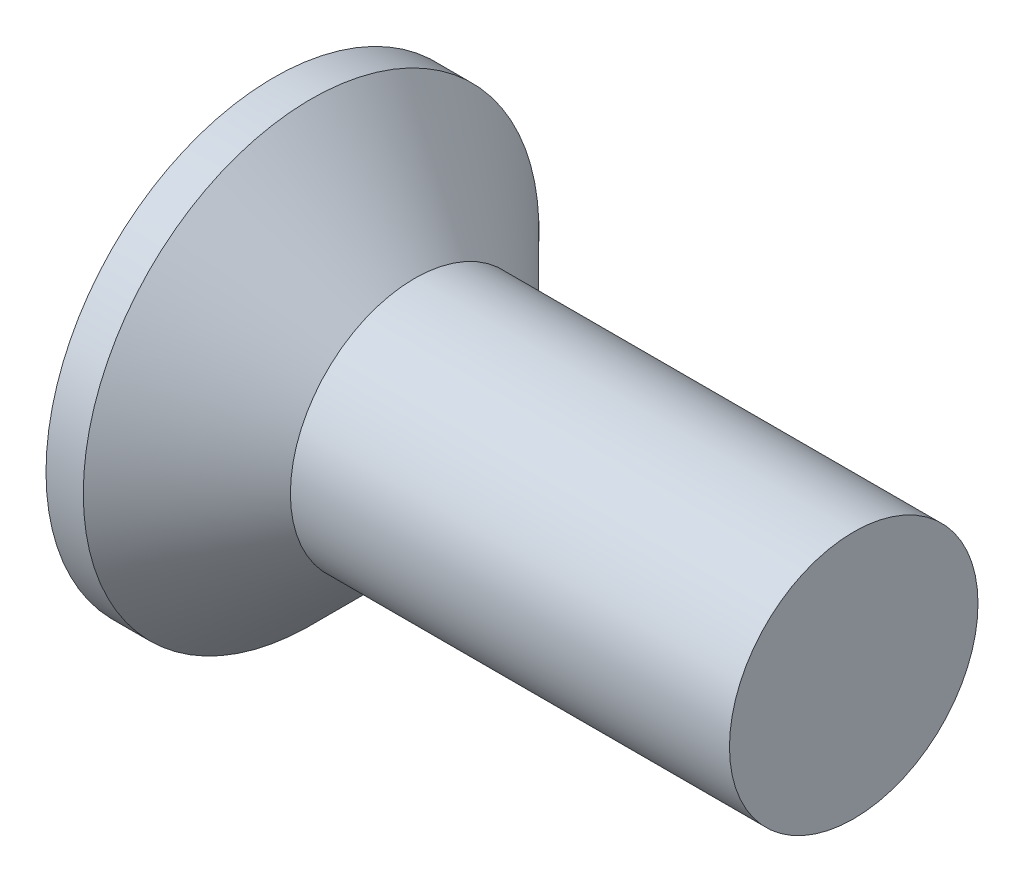
ISO-10303-21;
HEADER;
FILE_DESCRIPTION(('STEP AP214'),'2;1');
FILE_NAME('part.step','',(''),(''),'','','');
FILE_SCHEMA(('AUTOMOTIVE_DESIGN { 1 0 10303 214 1 1 1 1 }'));
ENDSEC;
DATA;
#1=APPLICATION_CONTEXT('core data for automotive mechanical design processes');
#2=APPLICATION_PROTOCOL_DEFINITION('international standard','automotive_design',2000,#1);
#3=PRODUCT_CONTEXT('',#1,'mechanical');
#4=PRODUCT('Part','Part','',(#3));
#5=PRODUCT_RELATED_PRODUCT_CATEGORY('part','',(#4));
#6=PRODUCT_DEFINITION_FORMATION('','',#4);
#7=PRODUCT_DEFINITION_CONTEXT('part definition',#1,'design');
#8=PRODUCT_DEFINITION('design','',#6,#7);
#9=PRODUCT_DEFINITION_SHAPE('','',#8);
#10=(LENGTH_UNIT() NAMED_UNIT(*) SI_UNIT(.MILLI.,.METRE.));
#11=(NAMED_UNIT(*) PLANE_ANGLE_UNIT() SI_UNIT($,.RADIAN.));
#12=(NAMED_UNIT(*) SI_UNIT($,.STERADIAN.) SOLID_ANGLE_UNIT());
#13=UNCERTAINTY_MEASURE_WITH_UNIT(LENGTH_MEASURE(1.E-05),#10,'distance_accuracy_value','');
#14=(GEOMETRIC_REPRESENTATION_CONTEXT(3) GLOBAL_UNCERTAINTY_ASSIGNED_CONTEXT((#13)) GLOBAL_UNIT_ASSIGNED_CONTEXT((#10,
#11,#12)) REPRESENTATION_CONTEXT('',''));
#15=CARTESIAN_POINT('',(0.,0.,0.));
#16=DIRECTION('',(0.,0.,1.));
#17=DIRECTION('',(1.,0.,0.));
#18=AXIS2_PLACEMENT_3D('',#15,#16,#17);
#19=CARTESIAN_POINT('',(0.,0.,0.));
#20=DIRECTION('',(-1.,0.,0.));
#21=DIRECTION('',(0.,0.,1.));
#22=AXIS2_PLACEMENT_3D('',#19,#20,#21);
#23=PLANE('',#22);
#24=CARTESIAN_POINT('',(0.,0.,0.));
#25=DIRECTION('',(-1.,0.,0.));
#26=DIRECTION('',(0.,0.,1.));
#27=AXIS2_PLACEMENT_3D('',#24,#25,#26);
#28=CIRCLE('',#27,2.75);
#29=CARTESIAN_POINT('',(0.,0.,2.75));
#30=VERTEX_POINT('',#29);
#31=EDGE_CURVE('E41',#30,#30,#28,.T.);
#32=ORIENTED_EDGE('',*,*,#31,.T.);
#33=EDGE_LOOP('',(#32));
#34=FACE_BOUND('',#33,.T.);
#35=DIRECTION('',(0.,1.,0.));
#36=VECTOR('',#35,1.);
#37=CARTESIAN_POINT('',(0.,-1.55,-0.395));
#38=LINE('',#37,#36);
#39=CARTESIAN_POINT('',(0.,-1.55,-0.395));
#40=VERTEX_POINT('',#39);
#41=CARTESIAN_POINT('',(0.,-0.394999999999999,-0.395));
#42=VERTEX_POINT('',#41);
#43=EDGE_CURVE('E102',#40,#42,#38,.T.);
#44=ORIENTED_EDGE('',*,*,#43,.T.);
#45=DIRECTION('',(0.,0.,-1.));
#46=VECTOR('',#45,1.);
#47=CARTESIAN_POINT('',(0.,-0.395000000000005,1.55));
#48=LINE('',#47,#46);
#49=CARTESIAN_POINT('',(0.,-0.394999999999994,-1.55));
#50=VERTEX_POINT('',#49);
#51=EDGE_CURVE('E82',#42,#50,#48,.T.);
#52=ORIENTED_EDGE('',*,*,#51,.T.);
#53=DIRECTION('',(0.,1.,0.));
#54=VECTOR('',#53,1.);
#55=CARTESIAN_POINT('',(0.,-0.394999999999994,-1.55));
#56=LINE('',#55,#54);
#57=CARTESIAN_POINT('',(0.,0.395000000000005,-1.55));
#58=VERTEX_POINT('',#57);
#59=EDGE_CURVE('E343',#50,#58,#56,.T.);
#60=ORIENTED_EDGE('',*,*,#59,.T.);
#61=DIRECTION('',(0.,0.,1.));
#62=VECTOR('',#61,1.);
#63=CARTESIAN_POINT('',(0.,0.395000000000005,-1.55));
#64=LINE('',#63,#62);
#65=CARTESIAN_POINT('',(0.,0.395000000000001,-0.395));
#66=VERTEX_POINT('',#65);
#67=EDGE_CURVE('E98',#58,#66,#64,.T.);
#68=ORIENTED_EDGE('',*,*,#67,.T.);
#69=CARTESIAN_POINT('',(0.,1.55,-0.395));
#70=VERTEX_POINT('',#69);
#71=EDGE_CURVE('E92',#66,#70,#38,.T.);
#72=ORIENTED_EDGE('',*,*,#71,.T.);
#73=DIRECTION('',(0.,0.,1.));
#74=VECTOR('',#73,1.);
#75=CARTESIAN_POINT('',(0.,1.55,-0.395));
#76=LINE('',#75,#74);
#77=CARTESIAN_POINT('',(0.,1.55,0.395));
#78=VERTEX_POINT('',#77);
#79=EDGE_CURVE('E95',#70,#78,#76,.T.);
#80=ORIENTED_EDGE('',*,*,#79,.T.);
#81=DIRECTION('',(0.,-1.,0.));
#82=VECTOR('',#81,1.);
#83=CARTESIAN_POINT('',(0.,1.55,0.395));
#84=LINE('',#83,#82);
#85=CARTESIAN_POINT('',(0.,0.394999999999998,0.395));
#86=VERTEX_POINT('',#85);
#87=EDGE_CURVE('E355',#78,#86,#84,.T.);
#88=ORIENTED_EDGE('',*,*,#87,.T.);
#89=CARTESIAN_POINT('',(0.,0.394999999999994,1.55));
#90=VERTEX_POINT('',#89);
#91=EDGE_CURVE('E338',#86,#90,#64,.T.);
#92=ORIENTED_EDGE('',*,*,#91,.T.);
#93=DIRECTION('',(0.,-1.,0.));
#94=VECTOR('',#93,1.);
#95=CARTESIAN_POINT('',(0.,0.394999999999994,1.55));
#96=LINE('',#95,#94);
#97=CARTESIAN_POINT('',(0.,-0.395000000000005,1.55));
#98=VERTEX_POINT('',#97);
#99=EDGE_CURVE('E324',#90,#98,#96,.T.);
#100=ORIENTED_EDGE('',*,*,#99,.T.);
#101=CARTESIAN_POINT('',(0.,-0.395000000000001,0.395));
#102=VERTEX_POINT('',#101);
#103=EDGE_CURVE('E336',#98,#102,#48,.T.);
#104=ORIENTED_EDGE('',*,*,#103,.T.);
#105=CARTESIAN_POINT('',(0.,-1.55,0.395));
#106=VERTEX_POINT('',#105);
#107=EDGE_CURVE('E108',#102,#106,#84,.T.);
#108=ORIENTED_EDGE('',*,*,#107,.T.);
#109=DIRECTION('',(0.,0.,-1.));
#110=VECTOR('',#109,1.);
#111=CARTESIAN_POINT('',(0.,-1.55,0.395));
#112=LINE('',#111,#110);
#113=EDGE_CURVE('E131',#106,#40,#112,.T.);
#114=ORIENTED_EDGE('',*,*,#113,.T.);
#115=EDGE_LOOP('',(#44,#52,#60,#68,#72,#80,#88,#92,#100,#104,#108,#114));
#116=FACE_BOUND('',#115,.T.);
#117=ADVANCED_FACE('F34',(#34,#116),#23,.T.);
#118=CARTESIAN_POINT('',(2.38373382624769,0.,0.168659889094269));
#119=DIRECTION('',(-0.0945267588569114,0.,-0.995522321125954));
#120=DIRECTION('',(-0.995522321125954,0.,0.0945267588569114));
#121=AXIS2_PLACEMENT_3D('',#118,#119,#120);
#122=PLANE('',#121);
#123=ORIENTED_EDGE('',*,*,#107,.F.);
#124=DIRECTION('',(0.991104257398676,0.0941072552097303,-0.09410725520973));
#125=VECTOR('',#124,1.);
#126=CARTESIAN_POINT('',(2.39946475118715,-0.167166207519493,0.167166207519491));
#127=LINE('',#126,#125);
#128=CARTESIAN_POINT('',(2.08,-0.197500000000003,0.1975));
#129=VERTEX_POINT('',#128);
#130=EDGE_CURVE('E126',#102,#129,#127,.T.);
#131=ORIENTED_EDGE('',*,*,#130,.T.);
#132=DIRECTION('',(0.835707904588478,0.543411029305728,-0.0793520726712617));
#133=VECTOR('',#132,1.);
#134=CARTESIAN_POINT('',(0.,-1.55,0.395));
#135=LINE('',#134,#133);
#136=EDGE_CURVE('E103',#106,#129,#135,.T.);
#137=ORIENTED_EDGE('',*,*,#136,.F.);
#138=EDGE_LOOP('',(#123,#131,#137));
#139=FACE_BOUND('',#138,.T.);
#140=ADVANCED_FACE('F155',(#139),#122,.T.);
#141=DIRECTION('',(0.835707904588477,-0.543411029305729,-0.0793520726712615));
#142=VECTOR('',#141,1.);
#143=CARTESIAN_POINT('',(0.,1.55,0.395));
#144=LINE('',#143,#142);
#145=CARTESIAN_POINT('',(2.08,0.197499999999997,0.1975));
#146=VERTEX_POINT('',#145);
#147=EDGE_CURVE('E48',#78,#146,#144,.T.);
#148=ORIENTED_EDGE('',*,*,#147,.T.);
#149=DIRECTION('',(-0.991104257398676,0.0941072552097295,0.0941072552097299));
#150=VECTOR('',#149,1.);
#151=CARTESIAN_POINT('',(2.39946475118715,0.167166207519486,0.167166207519491));
#152=LINE('',#151,#150);
#153=EDGE_CURVE('E351',#146,#86,#152,.T.);
#154=ORIENTED_EDGE('',*,*,#153,.T.);
#155=ORIENTED_EDGE('',*,*,#87,.F.);
#156=EDGE_LOOP('',(#148,#154,#155));
#157=FACE_BOUND('',#156,.T.);
#158=ADVANCED_FACE('F159',(#157),#122,.T.);
#159=CARTESIAN_POINT('',(2.38373382624769,0.,-0.168659889094269));
#160=DIRECTION('',(-0.0945267588569113,0.,0.995522321125954));
#161=DIRECTION('',(0.995522321125954,0.,0.0945267588569113));
#162=AXIS2_PLACEMENT_3D('',#159,#160,#161);
#163=PLANE('',#162);
#164=DIRECTION('',(0.835707904588478,0.543411029305728,0.0793520726712615));
#165=VECTOR('',#164,1.);
#166=CARTESIAN_POINT('',(0.,-1.55,-0.395));
#167=LINE('',#166,#165);
#168=CARTESIAN_POINT('',(2.08,-0.197500000000002,-0.1975));
#169=VERTEX_POINT('',#168);
#170=EDGE_CURVE('E57',#40,#169,#167,.T.);
#171=ORIENTED_EDGE('',*,*,#170,.T.);
#172=DIRECTION('',(-0.991104257398676,-0.0941072552097296,-0.0941072552097298));
#173=VECTOR('',#172,1.);
#174=CARTESIAN_POINT('',(2.39946475118715,-0.167166207519491,-0.167166207519488));
#175=LINE('',#174,#173);
#176=EDGE_CURVE('E11',#169,#42,#175,.T.);
#177=ORIENTED_EDGE('',*,*,#176,.T.);
#178=ORIENTED_EDGE('',*,*,#43,.F.);
#179=EDGE_LOOP('',(#171,#177,#178));
#180=FACE_BOUND('',#179,.T.);
#181=ADVANCED_FACE('F152',(#180),#163,.T.);
#182=ORIENTED_EDGE('',*,*,#71,.F.);
#183=DIRECTION('',(0.991104257398676,-0.0941072552097302,0.0941072552097298));
#184=VECTOR('',#183,1.);
#185=CARTESIAN_POINT('',(2.39946475118715,0.167166207519488,-0.167166207519488));
#186=LINE('',#185,#184);
#187=CARTESIAN_POINT('',(2.08,0.197499999999997,-0.1975));
#188=VERTEX_POINT('',#187);
#189=EDGE_CURVE('E111',#66,#188,#186,.T.);
#190=ORIENTED_EDGE('',*,*,#189,.T.);
#191=DIRECTION('',(0.835707904588477,-0.543411029305729,0.0793520726712615));
#192=VECTOR('',#191,1.);
#193=CARTESIAN_POINT('',(0.,1.55,-0.395));
#194=LINE('',#193,#192);
#195=EDGE_CURVE('E107',#70,#188,#194,.T.);
#196=ORIENTED_EDGE('',*,*,#195,.F.);
#197=EDGE_LOOP('',(#182,#190,#196));
#198=FACE_BOUND('',#197,.T.);
#199=ADVANCED_FACE('F110',(#198),#163,.T.);
#200=CARTESIAN_POINT('',(-6.34999999999999,0.,0.));
#201=DIRECTION('',(-1.,0.,0.));
#202=DIRECTION('',(0.,0.,1.));
#203=AXIS2_PLACEMENT_3D('',#200,#201,#202);
#204=CYLINDRICAL_SURFACE('',#203,2.75);
#205=CARTESIAN_POINT('',(0.450000000000005,0.,0.));
#206=DIRECTION('',(-1.,0.,0.));
#207=DIRECTION('',(0.,0.,1.));
#208=AXIS2_PLACEMENT_3D('',#205,#206,#207);
#209=CIRCLE('',#208,2.75);
#210=CARTESIAN_POINT('',(0.450000000000005,0.,2.75));
#211=VERTEX_POINT('',#210);
#212=EDGE_CURVE('E134',#211,#211,#209,.T.);
#213=ORIENTED_EDGE('',*,*,#212,.T.);
#214=EDGE_LOOP('',(#213));
#215=FACE_BOUND('',#214,.T.);
#216=ORIENTED_EDGE('',*,*,#31,.F.);
#217=EDGE_LOOP('',(#216));
#218=FACE_BOUND('',#217,.T.);
#219=ADVANCED_FACE('F141',(#215,#218),#204,.T.);
#220=CARTESIAN_POINT('',(0.450000000000005,0.,0.));
#221=DIRECTION('',(-1.,0.,0.));
#222=DIRECTION('',(0.,0.,1.));
#223=AXIS2_PLACEMENT_3D('',#220,#221,#222);
#224=CONICAL_SURFACE('',#223,2.75,0.78539816339745);
#225=CARTESIAN_POINT('',(1.7,0.,0.));
#226=DIRECTION('',(-1.,0.,0.));
#227=DIRECTION('',(0.,0.,1.));
#228=AXIS2_PLACEMENT_3D('',#225,#226,#227);
#229=CIRCLE('',#228,1.5);
#230=CARTESIAN_POINT('',(1.7,0.,1.5));
#231=VERTEX_POINT('',#230);
#232=EDGE_CURVE('E130',#231,#231,#229,.T.);
#233=ORIENTED_EDGE('',*,*,#232,.T.);
#234=EDGE_LOOP('',(#233));
#235=FACE_BOUND('',#234,.T.);
#236=ORIENTED_EDGE('',*,*,#212,.F.);
#237=EDGE_LOOP('',(#236));
#238=FACE_BOUND('',#237,.T.);
#239=ADVANCED_FACE('F143',(#235,#238),#224,.T.);
#240=CARTESIAN_POINT('',(-6.34999999999999,0.,0.));
#241=DIRECTION('',(-1.,0.,0.));
#242=DIRECTION('',(0.,0.,1.));
#243=AXIS2_PLACEMENT_3D('',#240,#241,#242);
#244=CYLINDRICAL_SURFACE('',#243,1.5);
#245=CARTESIAN_POINT('',(7.,0.,0.));
#246=DIRECTION('',(-1.,0.,0.));
#247=DIRECTION('',(0.,0.,1.));
#248=AXIS2_PLACEMENT_3D('',#245,#246,#247);
#249=CIRCLE('',#248,1.5);
#250=CARTESIAN_POINT('',(7.,0.,1.5));
#251=VERTEX_POINT('',#250);
#252=EDGE_CURVE('E127',#251,#251,#249,.T.);
#253=ORIENTED_EDGE('',*,*,#252,.T.);
#254=EDGE_LOOP('',(#253));
#255=FACE_BOUND('',#254,.T.);
#256=ORIENTED_EDGE('',*,*,#232,.F.);
#257=EDGE_LOOP('',(#256));
#258=FACE_BOUND('',#257,.T.);
#259=ADVANCED_FACE('F149',(#255,#258),#244,.T.);
#260=CARTESIAN_POINT('',(7.,1.5,0.));
#261=DIRECTION('',(1.,0.,0.));
#262=DIRECTION('',(0.,0.,-1.));
#263=AXIS2_PLACEMENT_3D('',#260,#261,#262);
#264=PLANE('',#263);
#265=ORIENTED_EDGE('',*,*,#252,.F.);
#266=EDGE_LOOP('',(#265));
#267=FACE_BOUND('',#266,.T.);
#268=ADVANCED_FACE('F179',(#267),#264,.T.);
#269=CARTESIAN_POINT('',(2.08,0.197499999999997,-0.1975));
#270=DIRECTION('',(1.,0.,0.));
#271=DIRECTION('',(0.,0.,-1.));
#272=AXIS2_PLACEMENT_3D('',#269,#270,#271);
#273=PLANE('',#272);
#274=DIRECTION('',(0.,1.,0.));
#275=VECTOR('',#274,1.);
#276=CARTESIAN_POINT('',(2.08,-0.197500000000002,-0.1975));
#277=LINE('',#276,#275);
#278=EDGE_CURVE('E122',#169,#188,#277,.T.);
#279=ORIENTED_EDGE('',*,*,#278,.F.);
#280=DIRECTION('',(0.,0.,-1.));
#281=VECTOR('',#280,1.);
#282=CARTESIAN_POINT('',(2.08,-0.197500000000002,0.1975));
#283=LINE('',#282,#281);
#284=EDGE_CURVE('E113',#129,#169,#283,.T.);
#285=ORIENTED_EDGE('',*,*,#284,.F.);
#286=DIRECTION('',(0.,-1.,0.));
#287=VECTOR('',#286,1.);
#288=CARTESIAN_POINT('',(2.08,0.197499999999997,0.1975));
#289=LINE('',#288,#287);
#290=EDGE_CURVE('E116',#146,#129,#289,.T.);
#291=ORIENTED_EDGE('',*,*,#290,.F.);
#292=DIRECTION('',(0.,0.,1.));
#293=VECTOR('',#292,1.);
#294=CARTESIAN_POINT('',(2.08,0.197499999999997,-0.1975));
#295=LINE('',#294,#293);
#296=EDGE_CURVE('E120',#188,#146,#295,.T.);
#297=ORIENTED_EDGE('',*,*,#296,.F.);
#298=EDGE_LOOP('',(#279,#285,#291,#297));
#299=FACE_BOUND('',#298,.T.);
#300=ADVANCED_FACE('F176',(#299),#273,.F.);
#301=CARTESIAN_POINT('',(0.,-1.55,-0.395));
#302=DIRECTION('',(-0.54513001368185,0.838351518268576,0.));
#303=DIRECTION('',(-0.838351518268576,-0.54513001368185,0.));
#304=AXIS2_PLACEMENT_3D('',#301,#302,#303);
#305=PLANE('',#304);
#306=ORIENTED_EDGE('',*,*,#170,.F.);
#307=ORIENTED_EDGE('',*,*,#113,.F.);
#308=ORIENTED_EDGE('',*,*,#136,.T.);
#309=ORIENTED_EDGE('',*,*,#284,.T.);
#310=EDGE_LOOP('',(#306,#307,#308,#309));
#311=FACE_BOUND('',#310,.T.);
#312=ADVANCED_FACE('F168',(#311),#305,.T.);
#313=CARTESIAN_POINT('',(2.08,0.197499999999997,0.1975));
#314=DIRECTION('',(-0.54513001368185,-0.838351518268575,0.));
#315=DIRECTION('',(0.838351518268576,-0.54513001368185,0.));
#316=AXIS2_PLACEMENT_3D('',#313,#314,#315);
#317=PLANE('',#316);
#318=ORIENTED_EDGE('',*,*,#147,.F.);
#319=ORIENTED_EDGE('',*,*,#79,.F.);
#320=ORIENTED_EDGE('',*,*,#195,.T.);
#321=ORIENTED_EDGE('',*,*,#296,.T.);
#322=EDGE_LOOP('',(#318,#319,#320,#321));
#323=FACE_BOUND('',#322,.T.);
#324=ADVANCED_FACE('F106',(#323),#317,.T.);
#325=CARTESIAN_POINT('',(2.38373382624769,-0.168659889094273,0.));
#326=DIRECTION('',(-0.0945267588569114,0.995522321125954,0.));
#327=DIRECTION('',(-0.995522321125954,-0.0945267588569114,0.));
#328=AXIS2_PLACEMENT_3D('',#325,#326,#327);
#329=PLANE('',#328);
#330=DIRECTION('',(0.835707904588478,0.0793520726712598,0.543411029305728));
#331=VECTOR('',#330,1.);
#332=CARTESIAN_POINT('',(0.,-0.394999999999994,-1.55));
#333=LINE('',#332,#331);
#334=EDGE_CURVE('E345',#50,#169,#333,.T.);
#335=ORIENTED_EDGE('',*,*,#334,.F.);
#336=ORIENTED_EDGE('',*,*,#51,.F.);
#337=ORIENTED_EDGE('',*,*,#176,.F.);
#338=EDGE_LOOP('',(#335,#336,#337));
#339=FACE_BOUND('',#338,.T.);
#340=ADVANCED_FACE('F175',(#339),#329,.T.);
#341=CARTESIAN_POINT('',(2.38373382624769,0.168659889094268,0.));
#342=DIRECTION('',(-0.0945267588569113,-0.995522321125954,0.));
#343=DIRECTION('',(0.995522321125954,-0.0945267588569113,0.));
#344=AXIS2_PLACEMENT_3D('',#341,#342,#343);
#345=PLANE('',#344);
#346=ORIENTED_EDGE('',*,*,#67,.F.);
#347=DIRECTION('',(0.835707904588478,-0.0793520726712634,0.543411029305728));
#348=VECTOR('',#347,1.);
#349=CARTESIAN_POINT('',(0.,0.395000000000005,-1.55));
#350=LINE('',#349,#348);
#351=EDGE_CURVE('E73',#58,#188,#350,.T.);
#352=ORIENTED_EDGE('',*,*,#351,.T.);
#353=ORIENTED_EDGE('',*,*,#189,.F.);
#354=EDGE_LOOP('',(#346,#352,#353));
#355=FACE_BOUND('',#354,.T.);
#356=ADVANCED_FACE('F219',(#355),#345,.T.);
#357=CARTESIAN_POINT('',(0.,0.395000000000005,-1.55));
#358=DIRECTION('',(-0.54513001368185,0.,0.838351518268576));
#359=DIRECTION('',(-0.838351518268576,0.,-0.54513001368185));
#360=AXIS2_PLACEMENT_3D('',#357,#358,#359);
#361=PLANE('',#360);
#362=ORIENTED_EDGE('',*,*,#351,.F.);
#363=ORIENTED_EDGE('',*,*,#59,.F.);
#364=ORIENTED_EDGE('',*,*,#334,.T.);
#365=ORIENTED_EDGE('',*,*,#278,.T.);
#366=EDGE_LOOP('',(#362,#363,#364,#365));
#367=FACE_BOUND('',#366,.T.);
#368=ADVANCED_FACE('F227',(#367),#361,.T.);
#369=ORIENTED_EDGE('',*,*,#103,.F.);
#370=DIRECTION('',(0.835707904588477,0.0793520726712634,-0.543411029305728));
#371=VECTOR('',#370,1.);
#372=CARTESIAN_POINT('',(0.,-0.395000000000005,1.55));
#373=LINE('',#372,#371);
#374=EDGE_CURVE('E321',#98,#129,#373,.T.);
#375=ORIENTED_EDGE('',*,*,#374,.T.);
#376=ORIENTED_EDGE('',*,*,#130,.F.);
#377=EDGE_LOOP('',(#369,#375,#376));
#378=FACE_BOUND('',#377,.T.);
#379=ADVANCED_FACE('F221',(#378),#329,.T.);
#380=DIRECTION('',(0.835707904588477,-0.0793520726712596,-0.543411029305729));
#381=VECTOR('',#380,1.);
#382=CARTESIAN_POINT('',(0.,0.394999999999994,1.55));
#383=LINE('',#382,#381);
#384=EDGE_CURVE('E332',#90,#146,#383,.T.);
#385=ORIENTED_EDGE('',*,*,#384,.F.);
#386=ORIENTED_EDGE('',*,*,#91,.F.);
#387=ORIENTED_EDGE('',*,*,#153,.F.);
#388=EDGE_LOOP('',(#385,#386,#387));
#389=FACE_BOUND('',#388,.T.);
#390=ADVANCED_FACE('F229',(#389),#345,.T.);
#391=CARTESIAN_POINT('',(2.08,-0.197500000000003,0.1975));
#392=DIRECTION('',(-0.54513001368185,0.,-0.838351518268575));
#393=DIRECTION('',(0.838351518268576,0.,-0.54513001368185));
#394=AXIS2_PLACEMENT_3D('',#391,#392,#393);
#395=PLANE('',#394);
#396=ORIENTED_EDGE('',*,*,#374,.F.);
#397=ORIENTED_EDGE('',*,*,#99,.F.);
#398=ORIENTED_EDGE('',*,*,#384,.T.);
#399=ORIENTED_EDGE('',*,*,#290,.T.);
#400=EDGE_LOOP('',(#396,#397,#398,#399));
#401=FACE_BOUND('',#400,.T.);
#402=ADVANCED_FACE('F248',(#401),#395,.T.);
#403=CLOSED_SHELL('',(#117,#140,#158,#181,#199,#219,#239,#259,#268,#300,#312,#324,#340,#356,
#368,#379,#390,#402));
#404=MANIFOLD_SOLID_BREP('B2',#403);
#405=ADVANCED_BREP_SHAPE_REPRESENTATION('',(#18,#404),#14);
#406=SHAPE_DEFINITION_REPRESENTATION(#9,#405);
ENDSEC;
END-ISO-10303-21;
